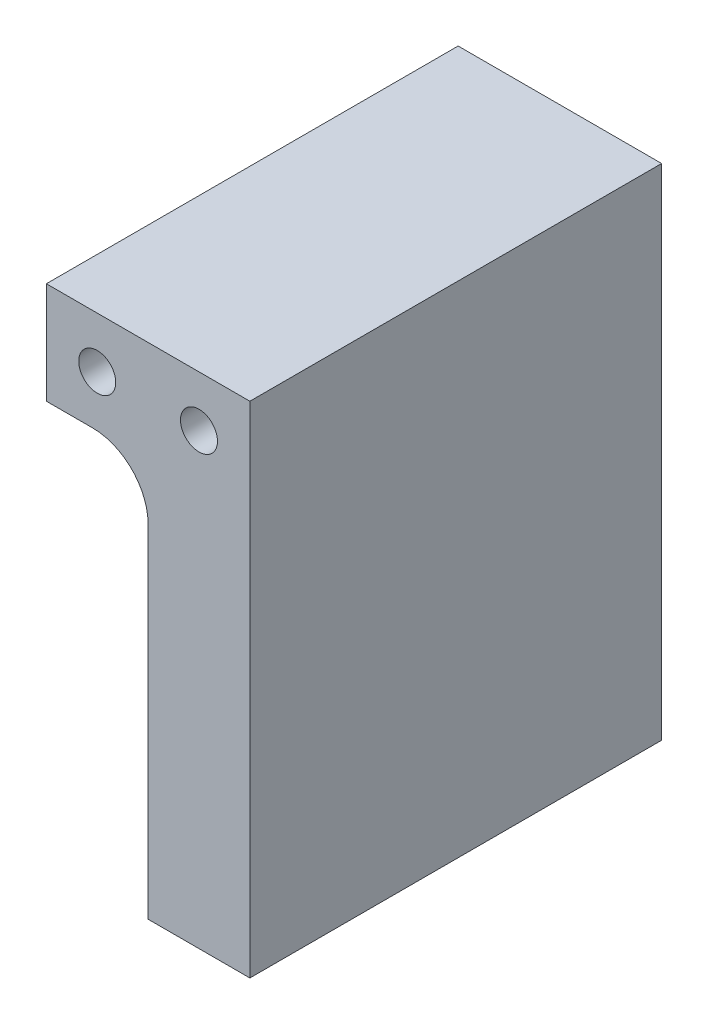
ISO-10303-21;
HEADER;
FILE_DESCRIPTION(('STEP AP214'),'2;1');
FILE_NAME('part.step','',(''),(''),'','','');
FILE_SCHEMA(('AUTOMOTIVE_DESIGN { 1 0 10303 214 1 1 1 1 }'));
ENDSEC;
DATA;
#1=APPLICATION_CONTEXT('core data for automotive mechanical design processes');
#2=APPLICATION_PROTOCOL_DEFINITION('international standard','automotive_design',2000,#1);
#3=PRODUCT_CONTEXT('',#1,'mechanical');
#4=PRODUCT('Part','Part','',(#3));
#5=PRODUCT_RELATED_PRODUCT_CATEGORY('part','',(#4));
#6=PRODUCT_DEFINITION_FORMATION('','',#4);
#7=PRODUCT_DEFINITION_CONTEXT('part definition',#1,'design');
#8=PRODUCT_DEFINITION('design','',#6,#7);
#9=PRODUCT_DEFINITION_SHAPE('','',#8);
#10=(LENGTH_UNIT() NAMED_UNIT(*) SI_UNIT(.MILLI.,.METRE.));
#11=(NAMED_UNIT(*) PLANE_ANGLE_UNIT() SI_UNIT($,.RADIAN.));
#12=(NAMED_UNIT(*) SI_UNIT($,.STERADIAN.) SOLID_ANGLE_UNIT());
#13=UNCERTAINTY_MEASURE_WITH_UNIT(LENGTH_MEASURE(1.E-05),#10,'distance_accuracy_value','');
#14=(GEOMETRIC_REPRESENTATION_CONTEXT(3) GLOBAL_UNCERTAINTY_ASSIGNED_CONTEXT((#13)) GLOBAL_UNIT_ASSIGNED_CONTEXT((#10,
#11,#12)) REPRESENTATION_CONTEXT('',''));
#15=CARTESIAN_POINT('',(0.,0.,0.));
#16=DIRECTION('',(0.,0.,1.));
#17=DIRECTION('',(1.,0.,0.));
#18=AXIS2_PLACEMENT_3D('',#15,#16,#17);
#19=CARTESIAN_POINT('',(0.,-270.,222.57));
#20=DIRECTION('',(-1.,0.,0.));
#21=DIRECTION('',(0.,0.,1.));
#22=AXIS2_PLACEMENT_3D('',#19,#20,#21);
#23=PLANE('',#22);
#24=DIRECTION('',(0.,1.,0.));
#25=VECTOR('',#24,1.);
#26=CARTESIAN_POINT('',(0.,-270.,0.));
#27=LINE('',#26,#25);
#28=CARTESIAN_POINT('',(0.,-270.,0.));
#29=VERTEX_POINT('',#28);
#30=CARTESIAN_POINT('',(0.,0.,0.));
#31=VERTEX_POINT('',#30);
#32=EDGE_CURVE('E128',#29,#31,#27,.T.);
#33=ORIENTED_EDGE('',*,*,#32,.T.);
#34=DIRECTION('',(0.,0.,-1.));
#35=VECTOR('',#34,1.);
#36=CARTESIAN_POINT('',(0.,0.,222.57));
#37=LINE('',#36,#35);
#38=CARTESIAN_POINT('',(0.,0.,222.57));
#39=VERTEX_POINT('',#38);
#40=EDGE_CURVE('E11',#39,#31,#37,.T.);
#41=ORIENTED_EDGE('',*,*,#40,.F.);
#42=DIRECTION('',(0.,1.,0.));
#43=VECTOR('',#42,1.);
#44=CARTESIAN_POINT('',(0.,-270.,222.57));
#45=LINE('',#44,#43);
#46=CARTESIAN_POINT('',(0.,-270.,222.57));
#47=VERTEX_POINT('',#46);
#48=EDGE_CURVE('E141',#47,#39,#45,.T.);
#49=ORIENTED_EDGE('',*,*,#48,.F.);
#50=DIRECTION('',(0.,0.,-1.));
#51=VECTOR('',#50,1.);
#52=CARTESIAN_POINT('',(0.,-270.,222.57));
#53=LINE('',#52,#51);
#54=EDGE_CURVE('E124',#47,#29,#53,.T.);
#55=ORIENTED_EDGE('',*,*,#54,.T.);
#56=EDGE_LOOP('',(#33,#41,#49,#55));
#57=FACE_BOUND('',#56,.T.);
#58=ADVANCED_FACE('F38',(#57),#23,.F.);
#59=CARTESIAN_POINT('',(0.,0.,222.57));
#60=DIRECTION('',(0.,-1.,0.));
#61=DIRECTION('',(0.,0.,-1.));
#62=AXIS2_PLACEMENT_3D('',#59,#60,#61);
#63=PLANE('',#62);
#64=DIRECTION('',(-1.,0.,0.));
#65=VECTOR('',#64,1.);
#66=CARTESIAN_POINT('',(0.,0.,0.));
#67=LINE('',#66,#65);
#68=CARTESIAN_POINT('',(-110.,0.,0.));
#69=VERTEX_POINT('',#68);
#70=EDGE_CURVE('E131',#31,#69,#67,.T.);
#71=ORIENTED_EDGE('',*,*,#70,.T.);
#72=DIRECTION('',(0.,0.,-1.));
#73=VECTOR('',#72,1.);
#74=CARTESIAN_POINT('',(-110.,0.,222.57));
#75=LINE('',#74,#73);
#76=CARTESIAN_POINT('',(-110.,0.,222.57));
#77=VERTEX_POINT('',#76);
#78=EDGE_CURVE('E46',#77,#69,#75,.T.);
#79=ORIENTED_EDGE('',*,*,#78,.F.);
#80=DIRECTION('',(-1.,0.,0.));
#81=VECTOR('',#80,1.);
#82=CARTESIAN_POINT('',(0.,0.,222.57));
#83=LINE('',#82,#81);
#84=EDGE_CURVE('E94',#39,#77,#83,.T.);
#85=ORIENTED_EDGE('',*,*,#84,.F.);
#86=ORIENTED_EDGE('',*,*,#40,.T.);
#87=EDGE_LOOP('',(#71,#79,#85,#86));
#88=FACE_BOUND('',#87,.T.);
#89=ADVANCED_FACE('F198',(#88),#63,.F.);
#90=CARTESIAN_POINT('',(-110.,0.,222.57));
#91=DIRECTION('',(1.,0.,0.));
#92=DIRECTION('',(0.,0.,-1.));
#93=AXIS2_PLACEMENT_3D('',#90,#91,#92);
#94=PLANE('',#93);
#95=DIRECTION('',(0.,-1.,0.));
#96=VECTOR('',#95,1.);
#97=CARTESIAN_POINT('',(-110.,0.,0.));
#98=LINE('',#97,#96);
#99=CARTESIAN_POINT('',(-110.,-55.,0.));
#100=VERTEX_POINT('',#99);
#101=EDGE_CURVE('E134',#69,#100,#98,.T.);
#102=ORIENTED_EDGE('',*,*,#101,.T.);
#103=DIRECTION('',(0.,0.,-1.));
#104=VECTOR('',#103,1.);
#105=CARTESIAN_POINT('',(-110.,-55.,222.57));
#106=LINE('',#105,#104);
#107=CARTESIAN_POINT('',(-110.,-55.,222.57));
#108=VERTEX_POINT('',#107);
#109=EDGE_CURVE('E145',#108,#100,#106,.T.);
#110=ORIENTED_EDGE('',*,*,#109,.F.);
#111=DIRECTION('',(0.,-1.,0.));
#112=VECTOR('',#111,1.);
#113=CARTESIAN_POINT('',(-110.,0.,222.57));
#114=LINE('',#113,#112);
#115=EDGE_CURVE('E153',#77,#108,#114,.T.);
#116=ORIENTED_EDGE('',*,*,#115,.F.);
#117=ORIENTED_EDGE('',*,*,#78,.T.);
#118=EDGE_LOOP('',(#102,#110,#116,#117));
#119=FACE_BOUND('',#118,.T.);
#120=ADVANCED_FACE('F151',(#119),#94,.F.);
#121=CARTESIAN_POINT('',(-110.,-55.,222.57));
#122=DIRECTION('',(0.,1.,0.));
#123=DIRECTION('',(0.,0.,1.));
#124=AXIS2_PLACEMENT_3D('',#121,#122,#123);
#125=PLANE('',#124);
#126=DIRECTION('',(1.,0.,0.));
#127=VECTOR('',#126,1.);
#128=CARTESIAN_POINT('',(-110.,-55.,0.));
#129=LINE('',#128,#127);
#130=CARTESIAN_POINT('',(-85.0000000000002,-55.,0.));
#131=VERTEX_POINT('',#130);
#132=EDGE_CURVE('E136',#100,#131,#129,.T.);
#133=ORIENTED_EDGE('',*,*,#132,.T.);
#134=DIRECTION('',(0.,0.,-1.));
#135=VECTOR('',#134,1.);
#136=CARTESIAN_POINT('',(-85.0000000000002,-55.,222.57));
#137=LINE('',#136,#135);
#138=CARTESIAN_POINT('',(-85.0000000000002,-55.,222.57));
#139=VERTEX_POINT('',#138);
#140=EDGE_CURVE('E119',#139,#131,#137,.T.);
#141=ORIENTED_EDGE('',*,*,#140,.F.);
#142=DIRECTION('',(1.,0.,0.));
#143=VECTOR('',#142,1.);
#144=CARTESIAN_POINT('',(-110.,-55.,222.57));
#145=LINE('',#144,#143);
#146=EDGE_CURVE('E110',#108,#139,#145,.T.);
#147=ORIENTED_EDGE('',*,*,#146,.F.);
#148=ORIENTED_EDGE('',*,*,#109,.T.);
#149=EDGE_LOOP('',(#133,#141,#147,#148));
#150=FACE_BOUND('',#149,.T.);
#151=ADVANCED_FACE('F159',(#150),#125,.F.);
#152=CARTESIAN_POINT('',(-85.,-85.,222.57));
#153=DIRECTION('',(0.,0.,-1.));
#154=DIRECTION('',(-1.,0.,0.));
#155=AXIS2_PLACEMENT_3D('',#152,#153,#154);
#156=CYLINDRICAL_SURFACE('',#155,30.);
#157=CARTESIAN_POINT('',(-85.,-85.,0.));
#158=DIRECTION('',(0.,0.,-1.));
#159=DIRECTION('',(-1.,0.,0.));
#160=AXIS2_PLACEMENT_3D('',#157,#158,#159);
#161=CIRCLE('',#160,30.);
#162=CARTESIAN_POINT('',(-55.,-85.0000000000002,0.));
#163=VERTEX_POINT('',#162);
#164=EDGE_CURVE('E118',#131,#163,#161,.T.);
#165=ORIENTED_EDGE('',*,*,#164,.T.);
#166=DIRECTION('',(0.,0.,-1.));
#167=VECTOR('',#166,1.);
#168=CARTESIAN_POINT('',(-55.,-85.0000000000002,222.57));
#169=LINE('',#168,#167);
#170=CARTESIAN_POINT('',(-55.,-85.0000000000002,222.57));
#171=VERTEX_POINT('',#170);
#172=EDGE_CURVE('E115',#171,#163,#169,.T.);
#173=ORIENTED_EDGE('',*,*,#172,.F.);
#174=CARTESIAN_POINT('',(-85.,-85.,222.57));
#175=DIRECTION('',(0.,0.,-1.));
#176=DIRECTION('',(-1.,0.,0.));
#177=AXIS2_PLACEMENT_3D('',#174,#175,#176);
#178=CIRCLE('',#177,30.);
#179=EDGE_CURVE('E104',#139,#171,#178,.T.);
#180=ORIENTED_EDGE('',*,*,#179,.F.);
#181=ORIENTED_EDGE('',*,*,#140,.T.);
#182=EDGE_LOOP('',(#165,#173,#180,#181));
#183=FACE_BOUND('',#182,.T.);
#184=ADVANCED_FACE('F116',(#183),#156,.F.);
#185=CARTESIAN_POINT('',(-55.,-85.0000000000002,222.57));
#186=DIRECTION('',(1.,0.,0.));
#187=DIRECTION('',(0.,1.,0.));
#188=AXIS2_PLACEMENT_3D('',#185,#186,#187);
#189=PLANE('',#188);
#190=DIRECTION('',(0.,-1.,0.));
#191=VECTOR('',#190,1.);
#192=CARTESIAN_POINT('',(-55.,-85.0000000000002,0.));
#193=LINE('',#192,#191);
#194=CARTESIAN_POINT('',(-55.,-270.,0.));
#195=VERTEX_POINT('',#194);
#196=EDGE_CURVE('E80',#163,#195,#193,.T.);
#197=ORIENTED_EDGE('',*,*,#196,.T.);
#198=DIRECTION('',(0.,0.,-1.));
#199=VECTOR('',#198,1.);
#200=CARTESIAN_POINT('',(-55.,-270.,222.57));
#201=LINE('',#200,#199);
#202=CARTESIAN_POINT('',(-55.,-270.,222.57));
#203=VERTEX_POINT('',#202);
#204=EDGE_CURVE('E120',#203,#195,#201,.T.);
#205=ORIENTED_EDGE('',*,*,#204,.F.);
#206=DIRECTION('',(0.,-1.,0.));
#207=VECTOR('',#206,1.);
#208=CARTESIAN_POINT('',(-55.,-85.0000000000002,222.57));
#209=LINE('',#208,#207);
#210=EDGE_CURVE('E108',#171,#203,#209,.T.);
#211=ORIENTED_EDGE('',*,*,#210,.F.);
#212=ORIENTED_EDGE('',*,*,#172,.T.);
#213=EDGE_LOOP('',(#197,#205,#211,#212));
#214=FACE_BOUND('',#213,.T.);
#215=ADVANCED_FACE('F122',(#214),#189,.F.);
#216=CARTESIAN_POINT('',(-55.,-270.,222.57));
#217=DIRECTION('',(0.,1.,0.));
#218=DIRECTION('',(0.,0.,1.));
#219=AXIS2_PLACEMENT_3D('',#216,#217,#218);
#220=PLANE('',#219);
#221=DIRECTION('',(1.,0.,0.));
#222=VECTOR('',#221,1.);
#223=CARTESIAN_POINT('',(-55.,-270.,0.));
#224=LINE('',#223,#222);
#225=EDGE_CURVE('E86',#195,#29,#224,.T.);
#226=ORIENTED_EDGE('',*,*,#225,.T.);
#227=ORIENTED_EDGE('',*,*,#54,.F.);
#228=DIRECTION('',(1.,0.,0.));
#229=VECTOR('',#228,1.);
#230=CARTESIAN_POINT('',(-55.,-270.,222.57));
#231=LINE('',#230,#229);
#232=EDGE_CURVE('E54',#203,#47,#231,.T.);
#233=ORIENTED_EDGE('',*,*,#232,.F.);
#234=ORIENTED_EDGE('',*,*,#204,.T.);
#235=EDGE_LOOP('',(#226,#227,#233,#234));
#236=FACE_BOUND('',#235,.T.);
#237=ADVANCED_FACE('F180',(#236),#220,.F.);
#238=CARTESIAN_POINT('',(-85.,-85.,222.57));
#239=DIRECTION('',(0.,0.,-1.));
#240=DIRECTION('',(-1.,0.,0.));
#241=AXIS2_PLACEMENT_3D('',#238,#239,#240);
#242=PLANE('',#241);
#243=CARTESIAN_POINT('',(-82.5,-27.5,222.57));
#244=DIRECTION('',(0.,0.,1.));
#245=DIRECTION('',(1.,0.,0.));
#246=AXIS2_PLACEMENT_3D('',#243,#244,#245);
#247=CIRCLE('',#246,9.99999999999999);
#248=CARTESIAN_POINT('',(-72.5,-27.5,222.57));
#249=VERTEX_POINT('',#248);
#250=EDGE_CURVE('E172',#249,#249,#247,.T.);
#251=ORIENTED_EDGE('',*,*,#250,.F.);
#252=EDGE_LOOP('',(#251));
#253=FACE_BOUND('',#252,.T.);
#254=CARTESIAN_POINT('',(-27.5,-27.5,222.57));
#255=DIRECTION('',(0.,0.,1.));
#256=DIRECTION('',(1.,0.,0.));
#257=AXIS2_PLACEMENT_3D('',#254,#255,#256);
#258=CIRCLE('',#257,9.99999999999999);
#259=CARTESIAN_POINT('',(-17.5,-27.5,222.57));
#260=VERTEX_POINT('',#259);
#261=EDGE_CURVE('E166',#260,#260,#258,.T.);
#262=ORIENTED_EDGE('',*,*,#261,.F.);
#263=EDGE_LOOP('',(#262));
#264=FACE_BOUND('',#263,.T.);
#265=ORIENTED_EDGE('',*,*,#48,.T.);
#266=ORIENTED_EDGE('',*,*,#84,.T.);
#267=ORIENTED_EDGE('',*,*,#115,.T.);
#268=ORIENTED_EDGE('',*,*,#146,.T.);
#269=ORIENTED_EDGE('',*,*,#179,.T.);
#270=ORIENTED_EDGE('',*,*,#210,.T.);
#271=ORIENTED_EDGE('',*,*,#232,.T.);
#272=EDGE_LOOP('',(#265,#266,#267,#268,#269,#270,#271));
#273=FACE_BOUND('',#272,.T.);
#274=ADVANCED_FACE('F106',(#253,#264,#273),#242,.F.);
#275=CARTESIAN_POINT('',(-85.,-85.,0.));
#276=DIRECTION('',(0.,0.,-1.));
#277=DIRECTION('',(-1.,0.,0.));
#278=AXIS2_PLACEMENT_3D('',#275,#276,#277);
#279=PLANE('',#278);
#280=CARTESIAN_POINT('',(-82.5,-27.5,0.));
#281=DIRECTION('',(0.,0.,1.));
#282=DIRECTION('',(1.,0.,0.));
#283=AXIS2_PLACEMENT_3D('',#280,#281,#282);
#284=CIRCLE('',#283,9.99999999999997);
#285=CARTESIAN_POINT('',(-72.5,-27.5,0.));
#286=VERTEX_POINT('',#285);
#287=EDGE_CURVE('E169',#286,#286,#284,.T.);
#288=ORIENTED_EDGE('',*,*,#287,.T.);
#289=EDGE_LOOP('',(#288));
#290=FACE_BOUND('',#289,.T.);
#291=CARTESIAN_POINT('',(-27.5,-27.5,0.));
#292=DIRECTION('',(0.,0.,1.));
#293=DIRECTION('',(1.,0.,0.));
#294=AXIS2_PLACEMENT_3D('',#291,#292,#293);
#295=CIRCLE('',#294,9.99999999999997);
#296=CARTESIAN_POINT('',(-17.5,-27.5,0.));
#297=VERTEX_POINT('',#296);
#298=EDGE_CURVE('E132',#297,#297,#295,.T.);
#299=ORIENTED_EDGE('',*,*,#298,.T.);
#300=EDGE_LOOP('',(#299));
#301=FACE_BOUND('',#300,.T.);
#302=ORIENTED_EDGE('',*,*,#32,.F.);
#303=ORIENTED_EDGE('',*,*,#225,.F.);
#304=ORIENTED_EDGE('',*,*,#196,.F.);
#305=ORIENTED_EDGE('',*,*,#164,.F.);
#306=ORIENTED_EDGE('',*,*,#132,.F.);
#307=ORIENTED_EDGE('',*,*,#101,.F.);
#308=ORIENTED_EDGE('',*,*,#70,.F.);
#309=EDGE_LOOP('',(#302,#303,#304,#305,#306,#307,#308));
#310=FACE_BOUND('',#309,.T.);
#311=ADVANCED_FACE('F157',(#290,#301,#310),#279,.T.);
#312=CARTESIAN_POINT('',(-27.5,-27.5,222.57));
#313=DIRECTION('',(0.,0.,1.));
#314=DIRECTION('',(1.,0.,0.));
#315=AXIS2_PLACEMENT_3D('',#312,#313,#314);
#316=CYLINDRICAL_SURFACE('',#315,9.99999999999998);
#317=ORIENTED_EDGE('',*,*,#298,.F.);
#318=EDGE_LOOP('',(#317));
#319=FACE_BOUND('',#318,.T.);
#320=ORIENTED_EDGE('',*,*,#261,.T.);
#321=EDGE_LOOP('',(#320));
#322=FACE_BOUND('',#321,.T.);
#323=ADVANCED_FACE('F184',(#319,#322),#316,.F.);
#324=CARTESIAN_POINT('',(-82.5,-27.5,222.57));
#325=DIRECTION('',(0.,0.,1.));
#326=DIRECTION('',(1.,0.,0.));
#327=AXIS2_PLACEMENT_3D('',#324,#325,#326);
#328=CYLINDRICAL_SURFACE('',#327,9.99999999999998);
#329=ORIENTED_EDGE('',*,*,#287,.F.);
#330=EDGE_LOOP('',(#329));
#331=FACE_BOUND('',#330,.T.);
#332=ORIENTED_EDGE('',*,*,#250,.T.);
#333=EDGE_LOOP('',(#332));
#334=FACE_BOUND('',#333,.T.);
#335=ADVANCED_FACE('F176',(#331,#334),#328,.F.);
#336=CLOSED_SHELL('',(#58,#89,#120,#151,#184,#215,#237,#274,#311,#323,#335));
#337=MANIFOLD_SOLID_BREP('B2',#336);
#338=ADVANCED_BREP_SHAPE_REPRESENTATION('',(#18,#337),#14);
#339=SHAPE_DEFINITION_REPRESENTATION(#9,#338);
ENDSEC;
END-ISO-10303-21;
